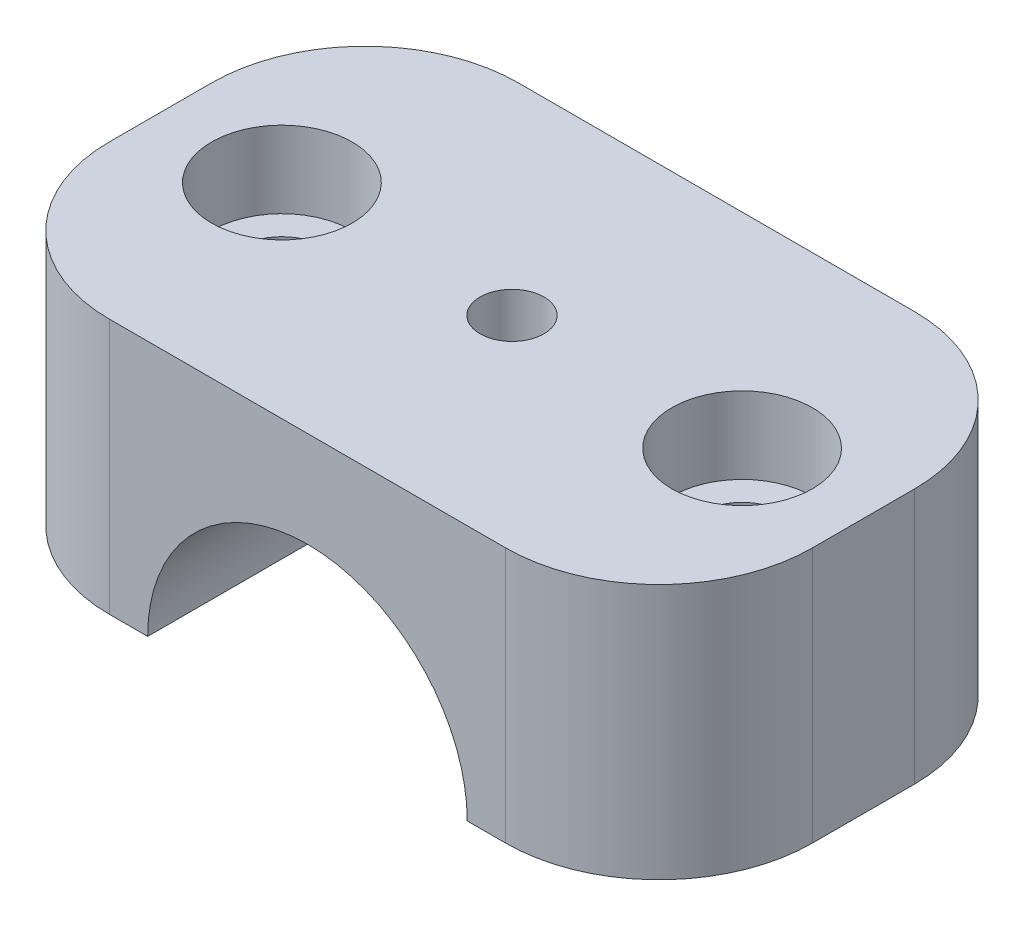
ISO-10303-21;
HEADER;
FILE_DESCRIPTION(('STEP AP214'),'2;1');
FILE_NAME('part.step','',(''),(''),'','','');
FILE_SCHEMA(('AUTOMOTIVE_DESIGN { 1 0 10303 214 1 1 1 1 }'));
ENDSEC;
DATA;
#1=APPLICATION_CONTEXT('core data for automotive mechanical design processes');
#2=APPLICATION_PROTOCOL_DEFINITION('international standard','automotive_design',2000,#1);
#3=PRODUCT_CONTEXT('',#1,'mechanical');
#4=PRODUCT('Part','Part','',(#3));
#5=PRODUCT_RELATED_PRODUCT_CATEGORY('part','',(#4));
#6=PRODUCT_DEFINITION_FORMATION('','',#4);
#7=PRODUCT_DEFINITION_CONTEXT('part definition',#1,'design');
#8=PRODUCT_DEFINITION('design','',#6,#7);
#9=PRODUCT_DEFINITION_SHAPE('','',#8);
#10=(LENGTH_UNIT() NAMED_UNIT(*) SI_UNIT(.MILLI.,.METRE.));
#11=(NAMED_UNIT(*) PLANE_ANGLE_UNIT() SI_UNIT($,.RADIAN.));
#12=(NAMED_UNIT(*) SI_UNIT($,.STERADIAN.) SOLID_ANGLE_UNIT());
#13=UNCERTAINTY_MEASURE_WITH_UNIT(LENGTH_MEASURE(1.E-05),#10,'distance_accuracy_value','');
#14=(GEOMETRIC_REPRESENTATION_CONTEXT(3) GLOBAL_UNCERTAINTY_ASSIGNED_CONTEXT((#13)) GLOBAL_UNIT_ASSIGNED_CONTEXT((#10,
#11,#12)) REPRESENTATION_CONTEXT('',''));
#15=CARTESIAN_POINT('',(0.,0.,0.));
#16=DIRECTION('',(0.,0.,1.));
#17=DIRECTION('',(1.,0.,0.));
#18=AXIS2_PLACEMENT_3D('',#15,#16,#17);
#19=CARTESIAN_POINT('',(-27.5,20.,32.));
#20=DIRECTION('',(0.,-1.,0.));
#21=DIRECTION('',(0.,0.,-1.));
#22=AXIS2_PLACEMENT_3D('',#19,#20,#21);
#23=PLANE('',#22);
#24=CARTESIAN_POINT('',(0.,20.,16.));
#25=DIRECTION('',(0.,1.,0.));
#26=DIRECTION('',(0.,0.,1.));
#27=AXIS2_PLACEMENT_3D('',#24,#25,#26);
#28=CIRCLE('',#27,2.5);
#29=CARTESIAN_POINT('',(0.,20.,18.5));
#30=VERTEX_POINT('',#29);
#31=EDGE_CURVE('E247',#30,#30,#28,.T.);
#32=ORIENTED_EDGE('',*,*,#31,.F.);
#33=EDGE_LOOP('',(#32));
#34=FACE_BOUND('',#33,.T.);
#35=CARTESIAN_POINT('',(18.,20.,16.));
#36=DIRECTION('',(0.,1.,0.));
#37=DIRECTION('',(0.,0.,1.));
#38=AXIS2_PLACEMENT_3D('',#35,#36,#37);
#39=CIRCLE('',#38,5.5);
#40=CARTESIAN_POINT('',(18.,20.,21.5));
#41=VERTEX_POINT('',#40);
#42=EDGE_CURVE('E232',#41,#41,#39,.T.);
#43=ORIENTED_EDGE('',*,*,#42,.F.);
#44=EDGE_LOOP('',(#43));
#45=FACE_BOUND('',#44,.T.);
#46=DIRECTION('',(0.,0.,-1.));
#47=VECTOR('',#46,1.);
#48=CARTESIAN_POINT('',(-27.5,20.,32.));
#49=LINE('',#48,#47);
#50=CARTESIAN_POINT('',(-27.5,20.,20.));
#51=VERTEX_POINT('',#50);
#52=CARTESIAN_POINT('',(-27.5,20.,12.));
#53=VERTEX_POINT('',#52);
#54=EDGE_CURVE('E147',#51,#53,#49,.T.);
#55=ORIENTED_EDGE('',*,*,#54,.F.);
#56=CARTESIAN_POINT('',(-15.5,20.,20.));
#57=DIRECTION('',(0.,-1.,0.));
#58=DIRECTION('',(0.,0.,-1.));
#59=AXIS2_PLACEMENT_3D('',#56,#57,#58);
#60=CIRCLE('',#59,12.);
#61=CARTESIAN_POINT('',(-15.5,20.,32.));
#62=VERTEX_POINT('',#61);
#63=EDGE_CURVE('E179',#51,#62,#60,.F.);
#64=ORIENTED_EDGE('',*,*,#63,.T.);
#65=DIRECTION('',(-1.,0.,0.));
#66=VECTOR('',#65,1.);
#67=CARTESIAN_POINT('',(-27.5,20.,32.));
#68=LINE('',#67,#66);
#69=CARTESIAN_POINT('',(15.5,20.,32.));
#70=VERTEX_POINT('',#69);
#71=EDGE_CURVE('E143',#70,#62,#68,.T.);
#72=ORIENTED_EDGE('',*,*,#71,.F.);
#73=CARTESIAN_POINT('',(15.5,20.,20.));
#74=DIRECTION('',(0.,-1.,0.));
#75=DIRECTION('',(0.,0.,-1.));
#76=AXIS2_PLACEMENT_3D('',#73,#74,#75);
#77=CIRCLE('',#76,12.);
#78=CARTESIAN_POINT('',(27.5,20.,20.));
#79=VERTEX_POINT('',#78);
#80=EDGE_CURVE('E175',#70,#79,#77,.F.);
#81=ORIENTED_EDGE('',*,*,#80,.T.);
#82=DIRECTION('',(0.,0.,-1.));
#83=VECTOR('',#82,1.);
#84=CARTESIAN_POINT('',(27.5,20.,32.));
#85=LINE('',#84,#83);
#86=CARTESIAN_POINT('',(27.5,20.,12.));
#87=VERTEX_POINT('',#86);
#88=EDGE_CURVE('E150',#79,#87,#85,.T.);
#89=ORIENTED_EDGE('',*,*,#88,.T.);
#90=CARTESIAN_POINT('',(15.5,20.,12.));
#91=DIRECTION('',(0.,-1.,0.));
#92=DIRECTION('',(0.,0.,-1.));
#93=AXIS2_PLACEMENT_3D('',#90,#91,#92);
#94=CIRCLE('',#93,12.);
#95=CARTESIAN_POINT('',(15.5,20.,0.));
#96=VERTEX_POINT('',#95);
#97=EDGE_CURVE('E177',#87,#96,#94,.F.);
#98=ORIENTED_EDGE('',*,*,#97,.T.);
#99=DIRECTION('',(-1.,0.,0.));
#100=VECTOR('',#99,1.);
#101=CARTESIAN_POINT('',(-27.5,20.,0.));
#102=LINE('',#101,#100);
#103=CARTESIAN_POINT('',(-15.5,20.,0.));
#104=VERTEX_POINT('',#103);
#105=EDGE_CURVE('E139',#96,#104,#102,.T.);
#106=ORIENTED_EDGE('',*,*,#105,.T.);
#107=CARTESIAN_POINT('',(-15.5,20.,12.));
#108=DIRECTION('',(0.,-1.,0.));
#109=DIRECTION('',(0.,0.,-1.));
#110=AXIS2_PLACEMENT_3D('',#107,#108,#109);
#111=CIRCLE('',#110,12.);
#112=EDGE_CURVE('E173',#104,#53,#111,.F.);
#113=ORIENTED_EDGE('',*,*,#112,.T.);
#114=EDGE_LOOP('',(#55,#64,#72,#81,#89,#98,#106,#113));
#115=FACE_BOUND('',#114,.T.);
#116=CARTESIAN_POINT('',(-18.,20.,16.));
#117=DIRECTION('',(0.,1.,0.));
#118=DIRECTION('',(0.,0.,1.));
#119=AXIS2_PLACEMENT_3D('',#116,#117,#118);
#120=CIRCLE('',#119,5.5);
#121=CARTESIAN_POINT('',(-18.,20.,21.5));
#122=VERTEX_POINT('',#121);
#123=EDGE_CURVE('E244',#122,#122,#120,.T.);
#124=ORIENTED_EDGE('',*,*,#123,.F.);
#125=EDGE_LOOP('',(#124));
#126=FACE_BOUND('',#125,.T.);
#127=ADVANCED_FACE('F36',(#34,#45,#115,#126),#23,.F.);
#128=CARTESIAN_POINT('',(-27.5,0.,32.));
#129=DIRECTION('',(0.,1.,0.));
#130=DIRECTION('',(0.,0.,1.));
#131=AXIS2_PLACEMENT_3D('',#128,#129,#130);
#132=PLANE('',#131);
#133=CARTESIAN_POINT('',(-18.,0.,16.));
#134=DIRECTION('',(0.,1.,0.));
#135=DIRECTION('',(0.,0.,1.));
#136=AXIS2_PLACEMENT_3D('',#133,#134,#135);
#137=CIRCLE('',#136,3.29999999999999);
#138=CARTESIAN_POINT('',(-18.,0.,19.3));
#139=VERTEX_POINT('',#138);
#140=EDGE_CURVE('E235',#139,#139,#137,.T.);
#141=ORIENTED_EDGE('',*,*,#140,.T.);
#142=EDGE_LOOP('',(#141));
#143=FACE_BOUND('',#142,.T.);
#144=DIRECTION('',(1.,0.,0.));
#145=VECTOR('',#144,1.);
#146=CARTESIAN_POINT('',(-27.5,0.,32.));
#147=LINE('',#146,#145);
#148=CARTESIAN_POINT('',(-15.5,0.,32.));
#149=VERTEX_POINT('',#148);
#150=CARTESIAN_POINT('',(-12.5,0.,32.));
#151=VERTEX_POINT('',#150);
#152=EDGE_CURVE('E197',#149,#151,#147,.T.);
#153=ORIENTED_EDGE('',*,*,#152,.F.);
#154=CARTESIAN_POINT('',(-15.5,0.,20.));
#155=DIRECTION('',(0.,1.,0.));
#156=DIRECTION('',(0.,0.,1.));
#157=AXIS2_PLACEMENT_3D('',#154,#155,#156);
#158=CIRCLE('',#157,12.);
#159=CARTESIAN_POINT('',(-27.5,0.,20.));
#160=VERTEX_POINT('',#159);
#161=EDGE_CURVE('E166',#149,#160,#158,.F.);
#162=ORIENTED_EDGE('',*,*,#161,.T.);
#163=DIRECTION('',(0.,0.,-1.));
#164=VECTOR('',#163,1.);
#165=CARTESIAN_POINT('',(-27.5,0.,32.));
#166=LINE('',#165,#164);
#167=CARTESIAN_POINT('',(-27.5,0.,12.));
#168=VERTEX_POINT('',#167);
#169=EDGE_CURVE('E155',#160,#168,#166,.T.);
#170=ORIENTED_EDGE('',*,*,#169,.T.);
#171=CARTESIAN_POINT('',(-15.5,0.,12.));
#172=DIRECTION('',(0.,1.,0.));
#173=DIRECTION('',(0.,0.,1.));
#174=AXIS2_PLACEMENT_3D('',#171,#172,#173);
#175=CIRCLE('',#174,12.);
#176=CARTESIAN_POINT('',(-15.5,0.,0.));
#177=VERTEX_POINT('',#176);
#178=EDGE_CURVE('E164',#168,#177,#175,.F.);
#179=ORIENTED_EDGE('',*,*,#178,.T.);
#180=DIRECTION('',(1.,0.,0.));
#181=VECTOR('',#180,1.);
#182=CARTESIAN_POINT('',(-27.5,0.,0.));
#183=LINE('',#182,#181);
#184=CARTESIAN_POINT('',(-12.5,0.,0.));
#185=VERTEX_POINT('',#184);
#186=EDGE_CURVE('E137',#177,#185,#183,.T.);
#187=ORIENTED_EDGE('',*,*,#186,.T.);
#188=DIRECTION('',(0.,0.,1.));
#189=VECTOR('',#188,1.);
#190=CARTESIAN_POINT('',(-12.5,0.,0.));
#191=LINE('',#190,#189);
#192=EDGE_CURVE('E126',#185,#151,#191,.T.);
#193=ORIENTED_EDGE('',*,*,#192,.T.);
#194=EDGE_LOOP('',(#153,#162,#170,#179,#187,#193));
#195=FACE_BOUND('',#194,.T.);
#196=ADVANCED_FACE('F266',(#143,#195),#132,.F.);
#197=CARTESIAN_POINT('',(-27.5,0.,32.));
#198=DIRECTION('',(1.,0.,0.));
#199=DIRECTION('',(0.,1.,0.));
#200=AXIS2_PLACEMENT_3D('',#197,#198,#199);
#201=PLANE('',#200);
#202=ORIENTED_EDGE('',*,*,#169,.F.);
#203=DIRECTION('',(0.,-1.,0.));
#204=VECTOR('',#203,1.);
#205=CARTESIAN_POINT('',(-27.5,0.,20.));
#206=LINE('',#205,#204);
#207=EDGE_CURVE('E171',#160,#51,#206,.F.);
#208=ORIENTED_EDGE('',*,*,#207,.T.);
#209=ORIENTED_EDGE('',*,*,#54,.T.);
#210=DIRECTION('',(0.,-1.,0.));
#211=VECTOR('',#210,1.);
#212=CARTESIAN_POINT('',(-27.5,0.,12.));
#213=LINE('',#212,#211);
#214=EDGE_CURVE('E168',#53,#168,#213,.T.);
#215=ORIENTED_EDGE('',*,*,#214,.T.);
#216=EDGE_LOOP('',(#202,#208,#209,#215));
#217=FACE_BOUND('',#216,.T.);
#218=ADVANCED_FACE('F215',(#217),#201,.F.);
#219=CARTESIAN_POINT('',(18.,0.,16.));
#220=DIRECTION('',(0.,1.,0.));
#221=DIRECTION('',(0.,0.,1.));
#222=AXIS2_PLACEMENT_3D('',#219,#220,#221);
#223=CIRCLE('',#222,3.29999999999999);
#224=CARTESIAN_POINT('',(18.,0.,19.3));
#225=VERTEX_POINT('',#224);
#226=EDGE_CURVE('E222',#225,#225,#223,.T.);
#227=ORIENTED_EDGE('',*,*,#226,.T.);
#228=EDGE_LOOP('',(#227));
#229=FACE_BOUND('',#228,.T.);
#230=CARTESIAN_POINT('',(12.5,0.,0.));
#231=VERTEX_POINT('',#230);
#232=CARTESIAN_POINT('',(15.5,0.,0.));
#233=VERTEX_POINT('',#232);
#234=EDGE_CURVE('E132',#231,#233,#183,.T.);
#235=ORIENTED_EDGE('',*,*,#234,.T.);
#236=CARTESIAN_POINT('',(15.5,0.,12.));
#237=DIRECTION('',(0.,1.,0.));
#238=DIRECTION('',(0.,0.,1.));
#239=AXIS2_PLACEMENT_3D('',#236,#237,#238);
#240=CIRCLE('',#239,12.);
#241=CARTESIAN_POINT('',(27.5,0.,12.));
#242=VERTEX_POINT('',#241);
#243=EDGE_CURVE('E11',#233,#242,#240,.F.);
#244=ORIENTED_EDGE('',*,*,#243,.T.);
#245=DIRECTION('',(0.,0.,-1.));
#246=VECTOR('',#245,1.);
#247=CARTESIAN_POINT('',(27.5,0.,32.));
#248=LINE('',#247,#246);
#249=CARTESIAN_POINT('',(27.5,0.,20.));
#250=VERTEX_POINT('',#249);
#251=EDGE_CURVE('E153',#250,#242,#248,.T.);
#252=ORIENTED_EDGE('',*,*,#251,.F.);
#253=CARTESIAN_POINT('',(15.5,0.,20.));
#254=DIRECTION('',(0.,1.,0.));
#255=DIRECTION('',(0.,0.,1.));
#256=AXIS2_PLACEMENT_3D('',#253,#254,#255);
#257=CIRCLE('',#256,12.);
#258=CARTESIAN_POINT('',(15.5,0.,32.));
#259=VERTEX_POINT('',#258);
#260=EDGE_CURVE('E49',#250,#259,#257,.F.);
#261=ORIENTED_EDGE('',*,*,#260,.T.);
#262=CARTESIAN_POINT('',(12.5,0.,32.));
#263=VERTEX_POINT('',#262);
#264=EDGE_CURVE('E134',#263,#259,#147,.T.);
#265=ORIENTED_EDGE('',*,*,#264,.F.);
#266=DIRECTION('',(0.,0.,1.));
#267=VECTOR('',#266,1.);
#268=CARTESIAN_POINT('',(12.5,0.,0.));
#269=LINE('',#268,#267);
#270=EDGE_CURVE('E123',#263,#231,#269,.F.);
#271=ORIENTED_EDGE('',*,*,#270,.T.);
#272=EDGE_LOOP('',(#235,#244,#252,#261,#265,#271));
#273=FACE_BOUND('',#272,.T.);
#274=ADVANCED_FACE('F131',(#229,#273),#132,.F.);
#275=CARTESIAN_POINT('',(27.5,0.,32.));
#276=DIRECTION('',(-1.,0.,0.));
#277=DIRECTION('',(0.,-1.,0.));
#278=AXIS2_PLACEMENT_3D('',#275,#276,#277);
#279=PLANE('',#278);
#280=ORIENTED_EDGE('',*,*,#251,.T.);
#281=DIRECTION('',(0.,1.,0.));
#282=VECTOR('',#281,1.);
#283=CARTESIAN_POINT('',(27.5,20.,12.));
#284=LINE('',#283,#282);
#285=EDGE_CURVE('E183',#242,#87,#284,.T.);
#286=ORIENTED_EDGE('',*,*,#285,.T.);
#287=ORIENTED_EDGE('',*,*,#88,.F.);
#288=DIRECTION('',(0.,1.,0.));
#289=VECTOR('',#288,1.);
#290=CARTESIAN_POINT('',(27.5,0.,20.));
#291=LINE('',#290,#289);
#292=EDGE_CURVE('E181',#79,#250,#291,.F.);
#293=ORIENTED_EDGE('',*,*,#292,.T.);
#294=EDGE_LOOP('',(#280,#286,#287,#293));
#295=FACE_BOUND('',#294,.T.);
#296=ADVANCED_FACE('F204',(#295),#279,.F.);
#297=CARTESIAN_POINT('',(0.,0.,32.));
#298=DIRECTION('',(0.,0.,-1.));
#299=DIRECTION('',(-1.,0.,0.));
#300=AXIS2_PLACEMENT_3D('',#297,#298,#299);
#301=PLANE('',#300);
#302=ORIENTED_EDGE('',*,*,#71,.T.);
#303=DIRECTION('',(0.,-1.,0.));
#304=VECTOR('',#303,1.);
#305=CARTESIAN_POINT('',(-15.5,0.,32.));
#306=LINE('',#305,#304);
#307=EDGE_CURVE('E161',#62,#149,#306,.T.);
#308=ORIENTED_EDGE('',*,*,#307,.T.);
#309=ORIENTED_EDGE('',*,*,#152,.T.);
#310=CARTESIAN_POINT('',(0.,0.,32.));
#311=DIRECTION('',(0.,0.,1.));
#312=DIRECTION('',(1.,0.,0.));
#313=AXIS2_PLACEMENT_3D('',#310,#311,#312);
#314=CIRCLE('',#313,12.5);
#315=EDGE_CURVE('E128',#263,#151,#314,.T.);
#316=ORIENTED_EDGE('',*,*,#315,.F.);
#317=ORIENTED_EDGE('',*,*,#264,.T.);
#318=DIRECTION('',(0.,1.,0.));
#319=VECTOR('',#318,1.);
#320=CARTESIAN_POINT('',(15.5,0.,32.));
#321=LINE('',#320,#319);
#322=EDGE_CURVE('E158',#259,#70,#321,.T.);
#323=ORIENTED_EDGE('',*,*,#322,.T.);
#324=EDGE_LOOP('',(#302,#308,#309,#316,#317,#323));
#325=FACE_BOUND('',#324,.T.);
#326=ADVANCED_FACE('F195',(#325),#301,.F.);
#327=CARTESIAN_POINT('',(0.,0.,0.));
#328=DIRECTION('',(0.,0.,-1.));
#329=DIRECTION('',(-1.,0.,0.));
#330=AXIS2_PLACEMENT_3D('',#327,#328,#329);
#331=PLANE('',#330);
#332=ORIENTED_EDGE('',*,*,#105,.F.);
#333=DIRECTION('',(0.,1.,0.));
#334=VECTOR('',#333,1.);
#335=CARTESIAN_POINT('',(15.5,0.,0.));
#336=LINE('',#335,#334);
#337=EDGE_CURVE('E56',#96,#233,#336,.F.);
#338=ORIENTED_EDGE('',*,*,#337,.T.);
#339=ORIENTED_EDGE('',*,*,#234,.F.);
#340=CARTESIAN_POINT('',(0.,0.,0.));
#341=DIRECTION('',(0.,0.,1.));
#342=DIRECTION('',(1.,0.,0.));
#343=AXIS2_PLACEMENT_3D('',#340,#341,#342);
#344=CIRCLE('',#343,12.5);
#345=EDGE_CURVE('E119',#231,#185,#344,.T.);
#346=ORIENTED_EDGE('',*,*,#345,.T.);
#347=ORIENTED_EDGE('',*,*,#186,.F.);
#348=DIRECTION('',(0.,-1.,0.));
#349=VECTOR('',#348,1.);
#350=CARTESIAN_POINT('',(-15.5,20.,0.));
#351=LINE('',#350,#349);
#352=EDGE_CURVE('E186',#177,#104,#351,.F.);
#353=ORIENTED_EDGE('',*,*,#352,.T.);
#354=EDGE_LOOP('',(#332,#338,#339,#346,#347,#353));
#355=FACE_BOUND('',#354,.T.);
#356=ADVANCED_FACE('F136',(#355),#331,.T.);
#357=CARTESIAN_POINT('',(0.,0.,0.));
#358=DIRECTION('',(0.,0.,1.));
#359=DIRECTION('',(1.,0.,0.));
#360=AXIS2_PLACEMENT_3D('',#357,#358,#359);
#361=CYLINDRICAL_SURFACE('',#360,12.5);
#362=CARTESIAN_POINT('',(0.,12.5,18.5));
#363=CARTESIAN_POINT('',(0.138942266981583,12.4999974395218,18.4999948887541));
#364=CARTESIAN_POINT('',(0.277949150503806,12.4976596294558,18.4883778925809));
#365=CARTESIAN_POINT('',(0.552033769222548,12.4885591405808,18.4422537497119));
#366=CARTESIAN_POINT('',(0.687108293853389,12.4817929465047,18.4077284179962));
#367=CARTESIAN_POINT('',(0.949325763158282,12.4645912319572,18.316896815948));
#368=CARTESIAN_POINT('',(1.07647616983283,12.454159226918,18.2606114078883));
#369=CARTESIAN_POINT('',(1.31951997216056,12.4307599508829,18.1279193812218));
#370=CARTESIAN_POINT('',(1.43541403768953,12.4177928308927,18.051513960982));
#371=CARTESIAN_POINT('',(1.65423369328716,12.3905541332492,17.8796537642714));
#372=CARTESIAN_POINT('',(1.75698487789631,12.3762686376087,17.783979111522));
#373=CARTESIAN_POINT('',(1.94509189152007,12.3481045113147,17.5767689590207));
#374=CARTESIAN_POINT('',(2.03044636192606,12.3342259125106,17.4652322216622));
#375=CARTESIAN_POINT('',(2.18207938336905,12.3083110453154,17.2282095174703));
#376=CARTESIAN_POINT('',(2.24817734716467,12.2962926841237,17.1026058905091));
#377=CARTESIAN_POINT('',(2.35826416645077,12.2756567014604,16.8417954524898));
#378=CARTESIAN_POINT('',(2.40225520609309,12.267038744049,16.7065895916341));
#379=CARTESIAN_POINT('',(2.46631324971207,12.2543201313051,16.4322890902302));
#380=CARTESIAN_POINT('',(2.48668624489694,12.2501617526797,16.2932686396444));
#381=CARTESIAN_POINT('',(2.5038803193153,12.2466593765157,16.0137254465891));
#382=CARTESIAN_POINT('',(2.50070380678375,12.247314886696,15.8732028591996));
#383=CARTESIAN_POINT('',(2.47113643275455,12.2533137787046,15.5968830299475));
#384=CARTESIAN_POINT('',(2.44509635060976,12.2585863214691,15.4610464859317));
#385=CARTESIAN_POINT('',(2.37109471155763,12.273113654,15.1957098083425));
#386=CARTESIAN_POINT('',(2.3231321077517,12.2823686339445,15.0662099777025));
#387=CARTESIAN_POINT('',(2.2063119591868,12.3038904625102,14.816211845741));
#388=CARTESIAN_POINT('',(2.13731537808029,12.3161772453426,14.6957803010771));
#389=CARTESIAN_POINT('',(1.9804839364317,12.3423654693265,14.468072875068));
#390=CARTESIAN_POINT('',(1.89264691089207,12.3562670959591,14.3607985078721));
#391=CARTESIAN_POINT('',(1.69874983640146,12.3844255310365,14.1604264938577));
#392=CARTESIAN_POINT('',(1.59239040303111,12.3986842302726,14.0676185803522));
#393=CARTESIAN_POINT('',(1.36546256015502,12.4257212178602,13.9011153842469));
#394=CARTESIAN_POINT('',(1.24489396844847,12.4384994872243,13.8274203467661));
#395=CARTESIAN_POINT('',(0.992648467197302,12.4611672540222,13.7011812269351));
#396=CARTESIAN_POINT('',(0.86095454896325,12.4710522212068,13.6486702658887));
#397=CARTESIAN_POINT('',(0.590372441121662,12.4867852246965,13.5665988149036));
#398=CARTESIAN_POINT('',(0.451485125181125,12.4926337500133,13.5370355448159));
#399=CARTESIAN_POINT('',(0.172948514067877,12.4995667966717,13.5021088655143));
#400=CARTESIAN_POINT('',(0.0333508208139413,12.5007293663117,13.4963489511493));
#401=CARTESIAN_POINT('',(-0.244812335481785,12.4983762982526,13.5081246473555));
#402=CARTESIAN_POINT('',(-0.383377856109483,12.4948609235362,13.5256589483815));
#403=CARTESIAN_POINT('',(-0.654264149866352,12.4835958002004,13.5831959338599));
#404=CARTESIAN_POINT('',(-0.786629870849757,12.4758844101052,13.6229951712448));
#405=CARTESIAN_POINT('',(-1.04280906874917,12.4570888015258,13.7237099566395));
#406=CARTESIAN_POINT('',(-1.16662190409385,12.4460043303557,13.7846270866921));
#407=CARTESIAN_POINT('',(-1.40385293421554,12.4214977883324,13.9267062266283));
#408=CARTESIAN_POINT('',(-1.51712531688047,12.4080487609263,14.0081069525974));
#409=CARTESIAN_POINT('',(-1.72854504779802,12.3803683707471,14.1885229780182));
#410=CARTESIAN_POINT('',(-1.82669077232691,12.3661369242097,14.2875401659997));
#411=CARTESIAN_POINT('',(-2.00660147693544,12.3382325889241,14.5021833797278));
#412=CARTESIAN_POINT('',(-2.08809425612164,12.3245715058326,14.6180393605533));
#413=CARTESIAN_POINT('',(-2.23046355012801,12.2996047949049,14.8620284033917));
#414=CARTESIAN_POINT('',(-2.29134088980726,12.2882990728336,14.9901609739339));
#415=CARTESIAN_POINT('',(-2.3903796039549,12.2694185146096,15.2544206153739));
#416=CARTESIAN_POINT('',(-2.42865874947763,12.2618243718047,15.3905021030258));
#417=CARTESIAN_POINT('',(-2.48177162906799,12.2511859198006,15.6673336337273));
#418=CARTESIAN_POINT('',(-2.49660842056278,12.2481410172778,15.8080830655234));
#419=CARTESIAN_POINT('',(-2.50230227716867,12.2469787407845,16.0875221613608));
#420=CARTESIAN_POINT('',(-2.49358947017724,12.2487729797325,16.2262028723175));
#421=CARTESIAN_POINT('',(-2.45338076025015,12.2568893371153,16.5000791247626));
#422=CARTESIAN_POINT('',(-2.42188504032325,12.2632114191792,16.635274694237));
#423=CARTESIAN_POINT('',(-2.33719642124739,12.279631605479,16.8980692781014));
#424=CARTESIAN_POINT('',(-2.28405626679336,12.2897205254708,17.025685901256));
#425=CARTESIAN_POINT('',(-2.15763661150401,12.3125428743543,17.2702593018361));
#426=CARTESIAN_POINT('',(-2.08435542193721,12.3252765249723,17.3872151843128));
#427=CARTESIAN_POINT('',(-1.91826478696604,12.3522240130806,17.6092889303758));
#428=CARTESIAN_POINT('',(-1.82514471808795,12.3664593227425,17.714171913169));
#429=CARTESIAN_POINT('',(-1.62266092253285,12.3946520467989,17.9069655138229));
#430=CARTESIAN_POINT('',(-1.51329346788334,12.4086093965796,17.9948722257932));
#431=CARTESIAN_POINT('',(-1.28004407272062,12.4348458096993,18.1520866098661));
#432=CARTESIAN_POINT('',(-1.15602221107459,12.4471057804812,18.2211900082001));
#433=CARTESIAN_POINT('',(-0.897915902351834,12.468378127125,18.3374653064915));
#434=CARTESIAN_POINT('',(-0.763840652157817,12.4773934284654,18.3846569738312));
#435=CARTESIAN_POINT('',(-0.524553722309449,12.4894093148843,18.4466298701118));
#436=CARTESIAN_POINT('',(-0.420704160034461,12.4933575789613,18.4666079842694));
#437=CARTESIAN_POINT('',(-0.211248813025167,12.4986538534973,18.4932947808959));
#438=CARTESIAN_POINT('',(-0.105643084371547,12.5000019468289,18.5000038862744));
#439=CARTESIAN_POINT('',(0.,12.5,18.5));
#440=B_SPLINE_CURVE_WITH_KNOTS('',3,(#362,#363,#364,#365,#366,#367,#368,#369,#370,#371,#372,
#373,#374,#375,#376,#377,#378,#379,#380,#381,#382,#383,#384,#385,#386,#387,#388,#389,#390,#391,
#392,#393,#394,#395,#396,#397,#398,#399,#400,#401,#402,#403,#404,#405,#406,#407,#408,#409,#410,
#411,#412,#413,#414,#415,#416,#417,#418,#419,#420,#421,#422,#423,#424,#425,#426,#427,#428,#429,
#430,#431,#432,#433,#434,#435,#436,#437,#438,#439),.UNSPECIFIED.,.T.,.F.,(4,2,2,2,2,2,2,2,2,2,2,
2,2,2,2,2,2,2,2,2,2,2,2,2,2,2,2,2,2,2,2,2,2,2,2,2,2,2,4),(0.,0.416440326653146,
0.833211626728307,1.24958433812585,1.66593225557716,2.08733167528047,2.50876399186841,
2.93402987514807,3.35925373412994,3.77890462758968,4.19851260703062,4.61179317515696,
5.02509348134324,5.44118725508981,5.85732886874176,6.28095631228377,6.70458918849551,
7.1288818713506,7.5531231424509,7.97026839190663,8.38739019144669,8.80076134876808,
9.21416348040056,9.63262665083397,10.0511347086483,10.4760157144806,10.9008797180867,
11.3235095258181,11.7460842082604,12.1609930641925,12.5758985873152,12.9897990313278,
13.4037341895467,13.8247019059786,14.2457663633233,14.6712374168909,15.096323887938,
15.4129693822474,15.7296047842749),.UNSPECIFIED.);
#441=CARTESIAN_POINT('',(0.,12.5,18.5));
#442=VERTEX_POINT('',#441);
#443=EDGE_CURVE('E40',#442,#442,#440,.T.);
#444=ORIENTED_EDGE('',*,*,#443,.T.);
#445=EDGE_LOOP('',(#444));
#446=FACE_BOUND('',#445,.T.);
#447=ORIENTED_EDGE('',*,*,#345,.F.);
#448=ORIENTED_EDGE('',*,*,#270,.F.);
#449=ORIENTED_EDGE('',*,*,#315,.T.);
#450=ORIENTED_EDGE('',*,*,#192,.F.);
#451=EDGE_LOOP('',(#447,#448,#449,#450));
#452=FACE_BOUND('',#451,.T.);
#453=ADVANCED_FACE('F121',(#446,#452),#361,.F.);
#454=CARTESIAN_POINT('',(-15.5,0.,20.));
#455=DIRECTION('',(0.,-1.,0.));
#456=DIRECTION('',(1.,0.,0.));
#457=AXIS2_PLACEMENT_3D('',#454,#455,#456);
#458=CYLINDRICAL_SURFACE('',#457,12.);
#459=ORIENTED_EDGE('',*,*,#63,.F.);
#460=ORIENTED_EDGE('',*,*,#207,.F.);
#461=ORIENTED_EDGE('',*,*,#161,.F.);
#462=ORIENTED_EDGE('',*,*,#307,.F.);
#463=EDGE_LOOP('',(#459,#460,#461,#462));
#464=FACE_BOUND('',#463,.T.);
#465=ADVANCED_FACE('F218',(#464),#458,.T.);
#466=CARTESIAN_POINT('',(15.5,0.,12.));
#467=DIRECTION('',(0.,-1.,0.));
#468=DIRECTION('',(1.,0.,0.));
#469=AXIS2_PLACEMENT_3D('',#466,#467,#468);
#470=CYLINDRICAL_SURFACE('',#469,12.);
#471=ORIENTED_EDGE('',*,*,#243,.F.);
#472=ORIENTED_EDGE('',*,*,#337,.F.);
#473=ORIENTED_EDGE('',*,*,#97,.F.);
#474=ORIENTED_EDGE('',*,*,#285,.F.);
#475=EDGE_LOOP('',(#471,#472,#473,#474));
#476=FACE_BOUND('',#475,.T.);
#477=ADVANCED_FACE('F207',(#476),#470,.T.);
#478=CARTESIAN_POINT('',(15.5,0.,20.));
#479=DIRECTION('',(0.,1.,0.));
#480=DIRECTION('',(-1.,0.,0.));
#481=AXIS2_PLACEMENT_3D('',#478,#479,#480);
#482=CYLINDRICAL_SURFACE('',#481,12.);
#483=ORIENTED_EDGE('',*,*,#260,.F.);
#484=ORIENTED_EDGE('',*,*,#292,.F.);
#485=ORIENTED_EDGE('',*,*,#80,.F.);
#486=ORIENTED_EDGE('',*,*,#322,.F.);
#487=EDGE_LOOP('',(#483,#484,#485,#486));
#488=FACE_BOUND('',#487,.T.);
#489=ADVANCED_FACE('F198',(#488),#482,.T.);
#490=CARTESIAN_POINT('',(-15.5,0.,12.));
#491=DIRECTION('',(0.,1.,0.));
#492=DIRECTION('',(-1.,0.,0.));
#493=AXIS2_PLACEMENT_3D('',#490,#491,#492);
#494=CYLINDRICAL_SURFACE('',#493,12.);
#495=ORIENTED_EDGE('',*,*,#112,.F.);
#496=ORIENTED_EDGE('',*,*,#352,.F.);
#497=ORIENTED_EDGE('',*,*,#178,.F.);
#498=ORIENTED_EDGE('',*,*,#214,.F.);
#499=EDGE_LOOP('',(#495,#496,#497,#498));
#500=FACE_BOUND('',#499,.T.);
#501=ADVANCED_FACE('F38',(#500),#494,.T.);
#502=CARTESIAN_POINT('',(18.,20.,16.));
#503=DIRECTION('',(0.,1.,0.));
#504=DIRECTION('',(0.,0.,1.));
#505=AXIS2_PLACEMENT_3D('',#502,#503,#504);
#506=CYLINDRICAL_SURFACE('',#505,3.3);
#507=ORIENTED_EDGE('',*,*,#226,.F.);
#508=EDGE_LOOP('',(#507));
#509=FACE_BOUND('',#508,.T.);
#510=CARTESIAN_POINT('',(18.,14.,16.));
#511=DIRECTION('',(0.,1.,0.));
#512=DIRECTION('',(0.,0.,1.));
#513=AXIS2_PLACEMENT_3D('',#510,#511,#512);
#514=CIRCLE('',#513,3.3);
#515=CARTESIAN_POINT('',(18.,14.,19.3));
#516=VERTEX_POINT('',#515);
#517=EDGE_CURVE('E226',#516,#516,#514,.T.);
#518=ORIENTED_EDGE('',*,*,#517,.T.);
#519=EDGE_LOOP('',(#518));
#520=FACE_BOUND('',#519,.T.);
#521=ADVANCED_FACE('F291',(#509,#520),#506,.F.);
#522=CARTESIAN_POINT('',(21.3,14.,16.));
#523=DIRECTION('',(0.,-1.,0.));
#524=DIRECTION('',(0.,0.,-1.));
#525=AXIS2_PLACEMENT_3D('',#522,#523,#524);
#526=PLANE('',#525);
#527=ORIENTED_EDGE('',*,*,#517,.F.);
#528=EDGE_LOOP('',(#527));
#529=FACE_BOUND('',#528,.T.);
#530=CARTESIAN_POINT('',(18.,14.,16.));
#531=DIRECTION('',(0.,1.,0.));
#532=DIRECTION('',(0.,0.,1.));
#533=AXIS2_PLACEMENT_3D('',#530,#531,#532);
#534=CIRCLE('',#533,5.5);
#535=CARTESIAN_POINT('',(18.,14.,21.5));
#536=VERTEX_POINT('',#535);
#537=EDGE_CURVE('E229',#536,#536,#534,.T.);
#538=ORIENTED_EDGE('',*,*,#537,.T.);
#539=EDGE_LOOP('',(#538));
#540=FACE_BOUND('',#539,.T.);
#541=ADVANCED_FACE('F295',(#529,#540),#526,.F.);
#542=CARTESIAN_POINT('',(18.,20.,16.));
#543=DIRECTION('',(0.,1.,0.));
#544=DIRECTION('',(0.,0.,1.));
#545=AXIS2_PLACEMENT_3D('',#542,#543,#544);
#546=CYLINDRICAL_SURFACE('',#545,5.5);
#547=ORIENTED_EDGE('',*,*,#537,.F.);
#548=EDGE_LOOP('',(#547));
#549=FACE_BOUND('',#548,.T.);
#550=ORIENTED_EDGE('',*,*,#42,.T.);
#551=EDGE_LOOP('',(#550));
#552=FACE_BOUND('',#551,.T.);
#553=ADVANCED_FACE('F301',(#549,#552),#546,.F.);
#554=CARTESIAN_POINT('',(-18.,20.,16.));
#555=DIRECTION('',(0.,1.,0.));
#556=DIRECTION('',(0.,0.,1.));
#557=AXIS2_PLACEMENT_3D('',#554,#555,#556);
#558=CYLINDRICAL_SURFACE('',#557,3.3);
#559=ORIENTED_EDGE('',*,*,#140,.F.);
#560=EDGE_LOOP('',(#559));
#561=FACE_BOUND('',#560,.T.);
#562=CARTESIAN_POINT('',(-18.,14.,16.));
#563=DIRECTION('',(0.,1.,0.));
#564=DIRECTION('',(0.,0.,1.));
#565=AXIS2_PLACEMENT_3D('',#562,#563,#564);
#566=CIRCLE('',#565,3.3);
#567=CARTESIAN_POINT('',(-18.,14.,19.3));
#568=VERTEX_POINT('',#567);
#569=EDGE_CURVE('E238',#568,#568,#566,.T.);
#570=ORIENTED_EDGE('',*,*,#569,.T.);
#571=EDGE_LOOP('',(#570));
#572=FACE_BOUND('',#571,.T.);
#573=ADVANCED_FACE('F362',(#561,#572),#558,.F.);
#574=CARTESIAN_POINT('',(-14.7,14.,16.));
#575=DIRECTION('',(0.,-1.,0.));
#576=DIRECTION('',(0.,0.,-1.));
#577=AXIS2_PLACEMENT_3D('',#574,#575,#576);
#578=PLANE('',#577);
#579=ORIENTED_EDGE('',*,*,#569,.F.);
#580=EDGE_LOOP('',(#579));
#581=FACE_BOUND('',#580,.T.);
#582=CARTESIAN_POINT('',(-18.,14.,16.));
#583=DIRECTION('',(0.,1.,0.));
#584=DIRECTION('',(0.,0.,1.));
#585=AXIS2_PLACEMENT_3D('',#582,#583,#584);
#586=CIRCLE('',#585,5.5);
#587=CARTESIAN_POINT('',(-18.,14.,21.5));
#588=VERTEX_POINT('',#587);
#589=EDGE_CURVE('E241',#588,#588,#586,.T.);
#590=ORIENTED_EDGE('',*,*,#589,.T.);
#591=EDGE_LOOP('',(#590));
#592=FACE_BOUND('',#591,.T.);
#593=ADVANCED_FACE('F261',(#581,#592),#578,.F.);
#594=CARTESIAN_POINT('',(-18.,20.,16.));
#595=DIRECTION('',(0.,1.,0.));
#596=DIRECTION('',(0.,0.,1.));
#597=AXIS2_PLACEMENT_3D('',#594,#595,#596);
#598=CYLINDRICAL_SURFACE('',#597,5.5);
#599=ORIENTED_EDGE('',*,*,#589,.F.);
#600=EDGE_LOOP('',(#599));
#601=FACE_BOUND('',#600,.T.);
#602=ORIENTED_EDGE('',*,*,#123,.T.);
#603=EDGE_LOOP('',(#602));
#604=FACE_BOUND('',#603,.T.);
#605=ADVANCED_FACE('F257',(#601,#604),#598,.F.);
#606=CARTESIAN_POINT('',(0.,0.,16.));
#607=DIRECTION('',(0.,1.,0.));
#608=DIRECTION('',(0.,0.,1.));
#609=AXIS2_PLACEMENT_3D('',#606,#607,#608);
#610=CYLINDRICAL_SURFACE('',#609,2.5);
#611=ORIENTED_EDGE('',*,*,#31,.T.);
#612=EDGE_LOOP('',(#611));
#613=FACE_BOUND('',#612,.T.);
#614=ORIENTED_EDGE('',*,*,#443,.F.);
#615=EDGE_LOOP('',(#614));
#616=FACE_BOUND('',#615,.T.);
#617=ADVANCED_FACE('F255',(#613,#616),#610,.F.);
#618=CLOSED_SHELL('',(#127,#196,#218,#274,#296,#326,#356,#453,#465,#477,#489,#501,#521,#541,
#553,#573,#593,#605,#617));
#619=MANIFOLD_SOLID_BREP('B2',#618);
#620=ADVANCED_BREP_SHAPE_REPRESENTATION('',(#18,#619),#14);
#621=SHAPE_DEFINITION_REPRESENTATION(#9,#620);
ENDSEC;
END-ISO-10303-21;
